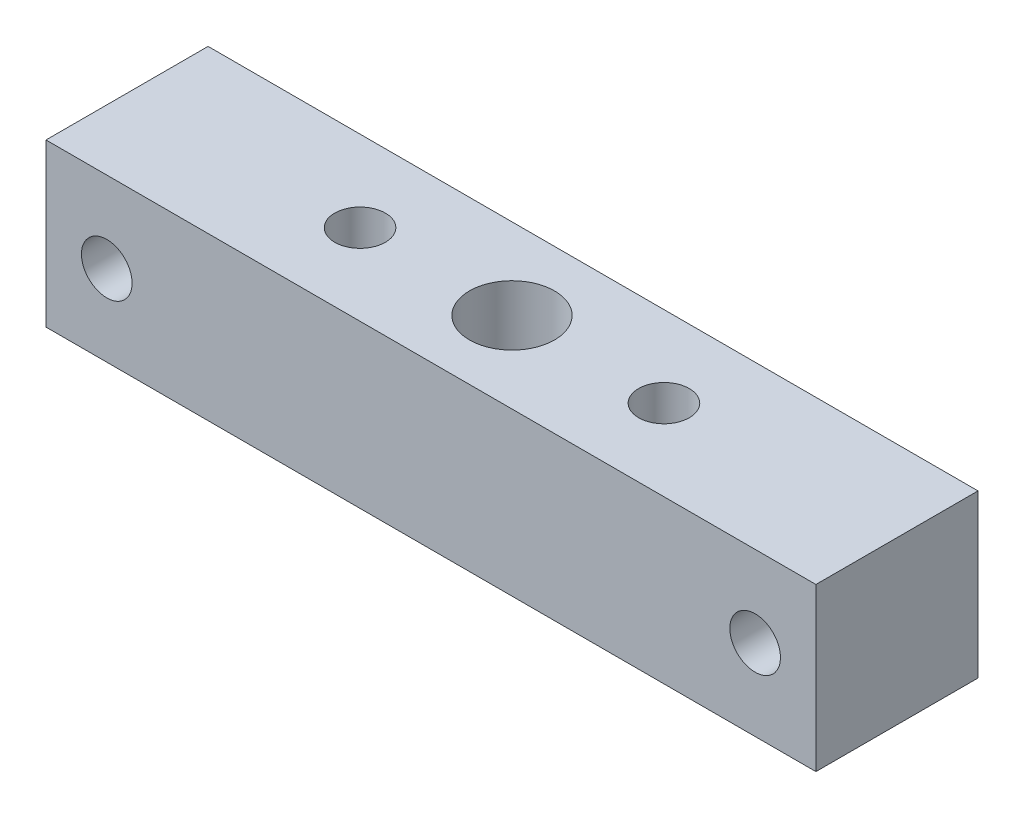
ISO-10303-21;
HEADER;
FILE_DESCRIPTION(('STEP AP214'),'2;1');
FILE_NAME('part.step','',(''),(''),'','','');
FILE_SCHEMA(('AUTOMOTIVE_DESIGN { 1 0 10303 214 1 1 1 1 }'));
ENDSEC;
DATA;
#1=APPLICATION_CONTEXT('core data for automotive mechanical design processes');
#2=APPLICATION_PROTOCOL_DEFINITION('international standard','automotive_design',2000,#1);
#3=PRODUCT_CONTEXT('',#1,'mechanical');
#4=PRODUCT('Part','Part','',(#3));
#5=PRODUCT_RELATED_PRODUCT_CATEGORY('part','',(#4));
#6=PRODUCT_DEFINITION_FORMATION('','',#4);
#7=PRODUCT_DEFINITION_CONTEXT('part definition',#1,'design');
#8=PRODUCT_DEFINITION('design','',#6,#7);
#9=PRODUCT_DEFINITION_SHAPE('','',#8);
#10=(LENGTH_UNIT() NAMED_UNIT(*) SI_UNIT(.MILLI.,.METRE.));
#11=(NAMED_UNIT(*) PLANE_ANGLE_UNIT() SI_UNIT($,.RADIAN.));
#12=(NAMED_UNIT(*) SI_UNIT($,.STERADIAN.) SOLID_ANGLE_UNIT());
#13=UNCERTAINTY_MEASURE_WITH_UNIT(LENGTH_MEASURE(1.E-05),#10,'distance_accuracy_value','');
#14=(GEOMETRIC_REPRESENTATION_CONTEXT(3) GLOBAL_UNCERTAINTY_ASSIGNED_CONTEXT((#13)) GLOBAL_UNIT_ASSIGNED_CONTEXT((#10,
#11,#12)) REPRESENTATION_CONTEXT('',''));
#15=CARTESIAN_POINT('',(0.,0.,0.));
#16=DIRECTION('',(0.,0.,1.));
#17=DIRECTION('',(1.,0.,0.));
#18=AXIS2_PLACEMENT_3D('',#15,#16,#17);
#19=CARTESIAN_POINT('',(0.,0.,8.));
#20=DIRECTION('',(1.,0.,0.));
#21=DIRECTION('',(0.,0.,-1.));
#22=AXIS2_PLACEMENT_3D('',#19,#20,#21);
#23=PLANE('',#22);
#24=DIRECTION('',(0.,-1.,0.));
#25=VECTOR('',#24,1.);
#26=CARTESIAN_POINT('',(0.,0.,0.));
#27=LINE('',#26,#25);
#28=CARTESIAN_POINT('',(0.,8.,0.));
#29=VERTEX_POINT('',#28);
#30=CARTESIAN_POINT('',(0.,0.,0.));
#31=VERTEX_POINT('',#30);
#32=EDGE_CURVE('E93',#29,#31,#27,.T.);
#33=ORIENTED_EDGE('',*,*,#32,.T.);
#34=DIRECTION('',(0.,0.,-1.));
#35=VECTOR('',#34,1.);
#36=CARTESIAN_POINT('',(0.,0.,8.));
#37=LINE('',#36,#35);
#38=CARTESIAN_POINT('',(0.,0.,8.));
#39=VERTEX_POINT('',#38);
#40=EDGE_CURVE('E11',#39,#31,#37,.T.);
#41=ORIENTED_EDGE('',*,*,#40,.F.);
#42=DIRECTION('',(0.,-1.,0.));
#43=VECTOR('',#42,1.);
#44=CARTESIAN_POINT('',(0.,0.,8.));
#45=LINE('',#44,#43);
#46=CARTESIAN_POINT('',(0.,8.,8.));
#47=VERTEX_POINT('',#46);
#48=EDGE_CURVE('E81',#47,#39,#45,.T.);
#49=ORIENTED_EDGE('',*,*,#48,.F.);
#50=DIRECTION('',(0.,0.,-1.));
#51=VECTOR('',#50,1.);
#52=CARTESIAN_POINT('',(0.,8.,8.));
#53=LINE('',#52,#51);
#54=EDGE_CURVE('E89',#47,#29,#53,.T.);
#55=ORIENTED_EDGE('',*,*,#54,.T.);
#56=EDGE_LOOP('',(#33,#41,#49,#55));
#57=FACE_BOUND('',#56,.T.);
#58=ADVANCED_FACE('F30',(#57),#23,.F.);
#59=CARTESIAN_POINT('',(0.,0.,8.));
#60=DIRECTION('',(0.,1.,0.));
#61=DIRECTION('',(0.,0.,1.));
#62=AXIS2_PLACEMENT_3D('',#59,#60,#61);
#63=PLANE('',#62);
#64=CARTESIAN_POINT('',(11.5,0.,4.));
#65=DIRECTION('',(0.,1.,0.));
#66=DIRECTION('',(0.,0.,1.));
#67=AXIS2_PLACEMENT_3D('',#64,#65,#66);
#68=CIRCLE('',#67,1.25);
#69=CARTESIAN_POINT('',(11.5,0.,5.25));
#70=VERTEX_POINT('',#69);
#71=EDGE_CURVE('E130',#70,#70,#68,.T.);
#72=ORIENTED_EDGE('',*,*,#71,.T.);
#73=EDGE_LOOP('',(#72));
#74=FACE_BOUND('',#73,.T.);
#75=CARTESIAN_POINT('',(26.5,0.,4.));
#76=DIRECTION('',(0.,1.,0.));
#77=DIRECTION('',(0.,0.,1.));
#78=AXIS2_PLACEMENT_3D('',#75,#76,#77);
#79=CIRCLE('',#78,1.25);
#80=CARTESIAN_POINT('',(26.5,0.,5.25));
#81=VERTEX_POINT('',#80);
#82=EDGE_CURVE('E124',#81,#81,#79,.T.);
#83=ORIENTED_EDGE('',*,*,#82,.T.);
#84=EDGE_LOOP('',(#83));
#85=FACE_BOUND('',#84,.T.);
#86=CARTESIAN_POINT('',(19.,0.,4.));
#87=DIRECTION('',(0.,1.,0.));
#88=DIRECTION('',(0.,0.,1.));
#89=AXIS2_PLACEMENT_3D('',#86,#87,#88);
#90=CIRCLE('',#89,2.1);
#91=CARTESIAN_POINT('',(19.,0.,6.1));
#92=VERTEX_POINT('',#91);
#93=EDGE_CURVE('E96',#92,#92,#90,.T.);
#94=ORIENTED_EDGE('',*,*,#93,.T.);
#95=EDGE_LOOP('',(#94));
#96=FACE_BOUND('',#95,.T.);
#97=DIRECTION('',(1.,0.,0.));
#98=VECTOR('',#97,1.);
#99=CARTESIAN_POINT('',(0.,0.,0.));
#100=LINE('',#99,#98);
#101=CARTESIAN_POINT('',(38.,0.,0.));
#102=VERTEX_POINT('',#101);
#103=EDGE_CURVE('E85',#31,#102,#100,.T.);
#104=ORIENTED_EDGE('',*,*,#103,.T.);
#105=DIRECTION('',(0.,0.,-1.));
#106=VECTOR('',#105,1.);
#107=CARTESIAN_POINT('',(38.,0.,8.));
#108=LINE('',#107,#106);
#109=CARTESIAN_POINT('',(38.,0.,8.));
#110=VERTEX_POINT('',#109);
#111=EDGE_CURVE('E38',#110,#102,#108,.T.);
#112=ORIENTED_EDGE('',*,*,#111,.F.);
#113=DIRECTION('',(1.,0.,0.));
#114=VECTOR('',#113,1.);
#115=CARTESIAN_POINT('',(0.,0.,8.));
#116=LINE('',#115,#114);
#117=EDGE_CURVE('E76',#39,#110,#116,.T.);
#118=ORIENTED_EDGE('',*,*,#117,.F.);
#119=ORIENTED_EDGE('',*,*,#40,.T.);
#120=EDGE_LOOP('',(#104,#112,#118,#119));
#121=FACE_BOUND('',#120,.T.);
#122=ADVANCED_FACE('F84',(#74,#85,#96,#121),#63,.F.);
#123=CARTESIAN_POINT('',(38.,0.,8.));
#124=DIRECTION('',(-1.,0.,0.));
#125=DIRECTION('',(0.,0.,1.));
#126=AXIS2_PLACEMENT_3D('',#123,#124,#125);
#127=PLANE('',#126);
#128=DIRECTION('',(0.,1.,0.));
#129=VECTOR('',#128,1.);
#130=CARTESIAN_POINT('',(38.,0.,0.));
#131=LINE('',#130,#129);
#132=CARTESIAN_POINT('',(38.,8.,0.));
#133=VERTEX_POINT('',#132);
#134=EDGE_CURVE('E63',#102,#133,#131,.T.);
#135=ORIENTED_EDGE('',*,*,#134,.T.);
#136=DIRECTION('',(0.,0.,-1.));
#137=VECTOR('',#136,1.);
#138=CARTESIAN_POINT('',(38.,8.,8.));
#139=LINE('',#138,#137);
#140=CARTESIAN_POINT('',(38.,8.,8.));
#141=VERTEX_POINT('',#140);
#142=EDGE_CURVE('E86',#141,#133,#139,.T.);
#143=ORIENTED_EDGE('',*,*,#142,.F.);
#144=DIRECTION('',(0.,1.,0.));
#145=VECTOR('',#144,1.);
#146=CARTESIAN_POINT('',(38.,0.,8.));
#147=LINE('',#146,#145);
#148=EDGE_CURVE('E79',#110,#141,#147,.T.);
#149=ORIENTED_EDGE('',*,*,#148,.F.);
#150=ORIENTED_EDGE('',*,*,#111,.T.);
#151=EDGE_LOOP('',(#135,#143,#149,#150));
#152=FACE_BOUND('',#151,.T.);
#153=ADVANCED_FACE('F87',(#152),#127,.F.);
#154=CARTESIAN_POINT('',(0.,8.,8.));
#155=DIRECTION('',(0.,-1.,0.));
#156=DIRECTION('',(0.,0.,-1.));
#157=AXIS2_PLACEMENT_3D('',#154,#155,#156);
#158=PLANE('',#157);
#159=CARTESIAN_POINT('',(11.5,8.,4.));
#160=DIRECTION('',(0.,1.,0.));
#161=DIRECTION('',(0.,0.,1.));
#162=AXIS2_PLACEMENT_3D('',#159,#160,#161);
#163=CIRCLE('',#162,1.24999999999999);
#164=CARTESIAN_POINT('',(11.5,8.,5.24999999999999));
#165=VERTEX_POINT('',#164);
#166=EDGE_CURVE('E133',#165,#165,#163,.T.);
#167=ORIENTED_EDGE('',*,*,#166,.F.);
#168=EDGE_LOOP('',(#167));
#169=FACE_BOUND('',#168,.T.);
#170=CARTESIAN_POINT('',(26.5,8.,4.));
#171=DIRECTION('',(0.,1.,0.));
#172=DIRECTION('',(0.,0.,1.));
#173=AXIS2_PLACEMENT_3D('',#170,#171,#172);
#174=CIRCLE('',#173,1.24999999999999);
#175=CARTESIAN_POINT('',(26.5,8.,5.24999999999999));
#176=VERTEX_POINT('',#175);
#177=EDGE_CURVE('E127',#176,#176,#174,.T.);
#178=ORIENTED_EDGE('',*,*,#177,.F.);
#179=EDGE_LOOP('',(#178));
#180=FACE_BOUND('',#179,.T.);
#181=CARTESIAN_POINT('',(19.,8.,4.));
#182=DIRECTION('',(0.,1.,0.));
#183=DIRECTION('',(0.,0.,1.));
#184=AXIS2_PLACEMENT_3D('',#181,#182,#183);
#185=CIRCLE('',#184,2.09999999999999);
#186=CARTESIAN_POINT('',(19.,8.,6.09999999999999));
#187=VERTEX_POINT('',#186);
#188=EDGE_CURVE('E109',#187,#187,#185,.T.);
#189=ORIENTED_EDGE('',*,*,#188,.F.);
#190=EDGE_LOOP('',(#189));
#191=FACE_BOUND('',#190,.T.);
#192=DIRECTION('',(-1.,0.,0.));
#193=VECTOR('',#192,1.);
#194=CARTESIAN_POINT('',(0.,8.,0.));
#195=LINE('',#194,#193);
#196=EDGE_CURVE('E69',#133,#29,#195,.T.);
#197=ORIENTED_EDGE('',*,*,#196,.T.);
#198=ORIENTED_EDGE('',*,*,#54,.F.);
#199=DIRECTION('',(-1.,0.,0.));
#200=VECTOR('',#199,1.);
#201=CARTESIAN_POINT('',(0.,8.,8.));
#202=LINE('',#201,#200);
#203=EDGE_CURVE('E46',#141,#47,#202,.T.);
#204=ORIENTED_EDGE('',*,*,#203,.F.);
#205=ORIENTED_EDGE('',*,*,#142,.T.);
#206=EDGE_LOOP('',(#197,#198,#204,#205));
#207=FACE_BOUND('',#206,.T.);
#208=ADVANCED_FACE('F101',(#169,#180,#191,#207),#158,.F.);
#209=CARTESIAN_POINT('',(0.,8.,8.));
#210=DIRECTION('',(0.,0.,-1.));
#211=DIRECTION('',(-1.,0.,0.));
#212=AXIS2_PLACEMENT_3D('',#209,#210,#211);
#213=PLANE('',#212);
#214=CARTESIAN_POINT('',(35.,4.,8.));
#215=DIRECTION('',(0.,0.,-1.));
#216=DIRECTION('',(-1.,0.,0.));
#217=AXIS2_PLACEMENT_3D('',#214,#215,#216);
#218=CIRCLE('',#217,1.25);
#219=CARTESIAN_POINT('',(33.75,4.,8.));
#220=VERTEX_POINT('',#219);
#221=EDGE_CURVE('E118',#220,#220,#218,.T.);
#222=ORIENTED_EDGE('',*,*,#221,.T.);
#223=EDGE_LOOP('',(#222));
#224=FACE_BOUND('',#223,.T.);
#225=CARTESIAN_POINT('',(3.,4.,8.));
#226=DIRECTION('',(0.,0.,-1.));
#227=DIRECTION('',(-1.,0.,0.));
#228=AXIS2_PLACEMENT_3D('',#225,#226,#227);
#229=CIRCLE('',#228,1.25);
#230=CARTESIAN_POINT('',(1.75000000000001,4.,8.));
#231=VERTEX_POINT('',#230);
#232=EDGE_CURVE('E112',#231,#231,#229,.T.);
#233=ORIENTED_EDGE('',*,*,#232,.T.);
#234=EDGE_LOOP('',(#233));
#235=FACE_BOUND('',#234,.T.);
#236=ORIENTED_EDGE('',*,*,#48,.T.);
#237=ORIENTED_EDGE('',*,*,#117,.T.);
#238=ORIENTED_EDGE('',*,*,#148,.T.);
#239=ORIENTED_EDGE('',*,*,#203,.T.);
#240=EDGE_LOOP('',(#236,#237,#238,#239));
#241=FACE_BOUND('',#240,.T.);
#242=ADVANCED_FACE('F77',(#224,#235,#241),#213,.F.);
#243=CARTESIAN_POINT('',(0.,8.,0.));
#244=DIRECTION('',(0.,0.,-1.));
#245=DIRECTION('',(-1.,0.,0.));
#246=AXIS2_PLACEMENT_3D('',#243,#244,#245);
#247=PLANE('',#246);
#248=CARTESIAN_POINT('',(35.,4.,0.));
#249=DIRECTION('',(0.,0.,-1.));
#250=DIRECTION('',(-1.,0.,0.));
#251=AXIS2_PLACEMENT_3D('',#248,#249,#250);
#252=CIRCLE('',#251,1.24999999999999);
#253=CARTESIAN_POINT('',(33.75,4.,0.));
#254=VERTEX_POINT('',#253);
#255=EDGE_CURVE('E121',#254,#254,#252,.T.);
#256=ORIENTED_EDGE('',*,*,#255,.F.);
#257=EDGE_LOOP('',(#256));
#258=FACE_BOUND('',#257,.T.);
#259=CARTESIAN_POINT('',(3.,4.,0.));
#260=DIRECTION('',(0.,0.,-1.));
#261=DIRECTION('',(-1.,0.,0.));
#262=AXIS2_PLACEMENT_3D('',#259,#260,#261);
#263=CIRCLE('',#262,1.24999999999999);
#264=CARTESIAN_POINT('',(1.75000000000002,4.,0.));
#265=VERTEX_POINT('',#264);
#266=EDGE_CURVE('E115',#265,#265,#263,.T.);
#267=ORIENTED_EDGE('',*,*,#266,.F.);
#268=EDGE_LOOP('',(#267));
#269=FACE_BOUND('',#268,.T.);
#270=ORIENTED_EDGE('',*,*,#32,.F.);
#271=ORIENTED_EDGE('',*,*,#196,.F.);
#272=ORIENTED_EDGE('',*,*,#134,.F.);
#273=ORIENTED_EDGE('',*,*,#103,.F.);
#274=EDGE_LOOP('',(#270,#271,#272,#273));
#275=FACE_BOUND('',#274,.T.);
#276=ADVANCED_FACE('F104',(#258,#269,#275),#247,.T.);
#277=CARTESIAN_POINT('',(19.,8.,4.));
#278=DIRECTION('',(0.,1.,0.));
#279=DIRECTION('',(0.,0.,1.));
#280=AXIS2_PLACEMENT_3D('',#277,#278,#279);
#281=CYLINDRICAL_SURFACE('',#280,2.09999999999999);
#282=ORIENTED_EDGE('',*,*,#93,.F.);
#283=EDGE_LOOP('',(#282));
#284=FACE_BOUND('',#283,.T.);
#285=ORIENTED_EDGE('',*,*,#188,.T.);
#286=EDGE_LOOP('',(#285));
#287=FACE_BOUND('',#286,.T.);
#288=ADVANCED_FACE('F146',(#284,#287),#281,.F.);
#289=CARTESIAN_POINT('',(3.,4.,0.));
#290=DIRECTION('',(0.,0.,-1.));
#291=DIRECTION('',(-1.,0.,0.));
#292=AXIS2_PLACEMENT_3D('',#289,#290,#291);
#293=CYLINDRICAL_SURFACE('',#292,1.24999999999999);
#294=ORIENTED_EDGE('',*,*,#232,.F.);
#295=EDGE_LOOP('',(#294));
#296=FACE_BOUND('',#295,.T.);
#297=ORIENTED_EDGE('',*,*,#266,.T.);
#298=EDGE_LOOP('',(#297));
#299=FACE_BOUND('',#298,.T.);
#300=ADVANCED_FACE('F148',(#296,#299),#293,.F.);
#301=CARTESIAN_POINT('',(35.,4.,0.));
#302=DIRECTION('',(0.,0.,-1.));
#303=DIRECTION('',(-1.,0.,0.));
#304=AXIS2_PLACEMENT_3D('',#301,#302,#303);
#305=CYLINDRICAL_SURFACE('',#304,1.24999999999999);
#306=ORIENTED_EDGE('',*,*,#221,.F.);
#307=EDGE_LOOP('',(#306));
#308=FACE_BOUND('',#307,.T.);
#309=ORIENTED_EDGE('',*,*,#255,.T.);
#310=EDGE_LOOP('',(#309));
#311=FACE_BOUND('',#310,.T.);
#312=ADVANCED_FACE('F155',(#308,#311),#305,.F.);
#313=CARTESIAN_POINT('',(26.5,8.,4.));
#314=DIRECTION('',(0.,1.,0.));
#315=DIRECTION('',(0.,0.,1.));
#316=AXIS2_PLACEMENT_3D('',#313,#314,#315);
#317=CYLINDRICAL_SURFACE('',#316,1.24999999999999);
#318=ORIENTED_EDGE('',*,*,#82,.F.);
#319=EDGE_LOOP('',(#318));
#320=FACE_BOUND('',#319,.T.);
#321=ORIENTED_EDGE('',*,*,#177,.T.);
#322=EDGE_LOOP('',(#321));
#323=FACE_BOUND('',#322,.T.);
#324=ADVANCED_FACE('F185',(#320,#323),#317,.F.);
#325=CARTESIAN_POINT('',(11.5,8.,4.));
#326=DIRECTION('',(0.,1.,0.));
#327=DIRECTION('',(0.,0.,1.));
#328=AXIS2_PLACEMENT_3D('',#325,#326,#327);
#329=CYLINDRICAL_SURFACE('',#328,1.24999999999999);
#330=ORIENTED_EDGE('',*,*,#71,.F.);
#331=EDGE_LOOP('',(#330));
#332=FACE_BOUND('',#331,.T.);
#333=ORIENTED_EDGE('',*,*,#166,.T.);
#334=EDGE_LOOP('',(#333));
#335=FACE_BOUND('',#334,.T.);
#336=ADVANCED_FACE('F137',(#332,#335),#329,.F.);
#337=CLOSED_SHELL('',(#58,#122,#153,#208,#242,#276,#288,#300,#312,#324,#336));
#338=MANIFOLD_SOLID_BREP('B2',#337);
#339=ADVANCED_BREP_SHAPE_REPRESENTATION('',(#18,#338),#14);
#340=SHAPE_DEFINITION_REPRESENTATION(#9,#339);
ENDSEC;
END-ISO-10303-21;
